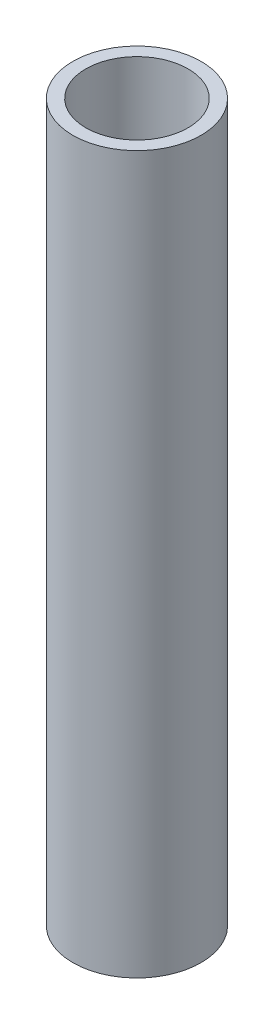
ISO-10303-21;
HEADER;
FILE_DESCRIPTION(('STEP AP214'),'2;1');
FILE_NAME('part.step','',(''),(''),'','','');
FILE_SCHEMA(('AUTOMOTIVE_DESIGN { 1 0 10303 214 1 1 1 1 }'));
ENDSEC;
DATA;
#1=APPLICATION_CONTEXT('core data for automotive mechanical design processes');
#2=APPLICATION_PROTOCOL_DEFINITION('international standard','automotive_design',2000,#1);
#3=PRODUCT_CONTEXT('',#1,'mechanical');
#4=PRODUCT('Part','Part','',(#3));
#5=PRODUCT_RELATED_PRODUCT_CATEGORY('part','',(#4));
#6=PRODUCT_DEFINITION_FORMATION('','',#4);
#7=PRODUCT_DEFINITION_CONTEXT('part definition',#1,'design');
#8=PRODUCT_DEFINITION('design','',#6,#7);
#9=PRODUCT_DEFINITION_SHAPE('','',#8);
#10=(LENGTH_UNIT() NAMED_UNIT(*) SI_UNIT(.MILLI.,.METRE.));
#11=(NAMED_UNIT(*) PLANE_ANGLE_UNIT() SI_UNIT($,.RADIAN.));
#12=(NAMED_UNIT(*) SI_UNIT($,.STERADIAN.) SOLID_ANGLE_UNIT());
#13=UNCERTAINTY_MEASURE_WITH_UNIT(LENGTH_MEASURE(1.E-05),#10,'distance_accuracy_value','');
#14=(GEOMETRIC_REPRESENTATION_CONTEXT(3) GLOBAL_UNCERTAINTY_ASSIGNED_CONTEXT((#13)) GLOBAL_UNIT_ASSIGNED_CONTEXT((#10,
#11,#12)) REPRESENTATION_CONTEXT('',''));
#15=CARTESIAN_POINT('',(0.,0.,0.));
#16=DIRECTION('',(0.,0.,1.));
#17=DIRECTION('',(1.,0.,0.));
#18=AXIS2_PLACEMENT_3D('',#15,#16,#17);
#19=CARTESIAN_POINT('',(0.,186.69,0.));
#20=DIRECTION('',(0.,1.,0.));
#21=DIRECTION('',(0.,0.,1.));
#22=AXIS2_PLACEMENT_3D('',#19,#20,#21);
#23=PLANE('',#22);
#24=CARTESIAN_POINT('',(0.,186.69,0.));
#25=DIRECTION('',(0.,1.,0.));
#26=DIRECTION('',(0.,0.,1.));
#27=AXIS2_PLACEMENT_3D('',#24,#25,#26);
#28=CIRCLE('',#27,16.7005);
#29=CARTESIAN_POINT('',(0.,186.69,16.7005));
#30=VERTEX_POINT('',#29);
#31=EDGE_CURVE('E10',#30,#30,#28,.T.);
#32=ORIENTED_EDGE('',*,*,#31,.T.);
#33=EDGE_LOOP('',(#32));
#34=FACE_BOUND('',#33,.T.);
#35=CARTESIAN_POINT('',(0.,186.69,0.));
#36=DIRECTION('',(0.,1.,0.));
#37=DIRECTION('',(0.,0.,1.));
#38=AXIS2_PLACEMENT_3D('',#35,#36,#37);
#39=CIRCLE('',#38,13.3223);
#40=CARTESIAN_POINT('',(0.,186.69,13.3223));
#41=VERTEX_POINT('',#40);
#42=EDGE_CURVE('E39',#41,#41,#39,.T.);
#43=ORIENTED_EDGE('',*,*,#42,.F.);
#44=EDGE_LOOP('',(#43));
#45=FACE_BOUND('',#44,.T.);
#46=ADVANCED_FACE('F28',(#34,#45),#23,.T.);
#47=CARTESIAN_POINT('',(0.,0.,0.));
#48=DIRECTION('',(0.,1.,0.));
#49=DIRECTION('',(0.,0.,1.));
#50=AXIS2_PLACEMENT_3D('',#47,#48,#49);
#51=PLANE('',#50);
#52=CARTESIAN_POINT('',(0.,0.,0.));
#53=DIRECTION('',(0.,1.,0.));
#54=DIRECTION('',(0.,0.,1.));
#55=AXIS2_PLACEMENT_3D('',#52,#53,#54);
#56=CIRCLE('',#55,16.7005);
#57=CARTESIAN_POINT('',(0.,0.,16.7005));
#58=VERTEX_POINT('',#57);
#59=EDGE_CURVE('E32',#58,#58,#56,.T.);
#60=ORIENTED_EDGE('',*,*,#59,.F.);
#61=EDGE_LOOP('',(#60));
#62=FACE_BOUND('',#61,.T.);
#63=CARTESIAN_POINT('',(0.,0.,0.));
#64=DIRECTION('',(0.,1.,0.));
#65=DIRECTION('',(0.,0.,1.));
#66=AXIS2_PLACEMENT_3D('',#63,#64,#65);
#67=CIRCLE('',#66,13.3223);
#68=CARTESIAN_POINT('',(0.,0.,13.3223));
#69=VERTEX_POINT('',#68);
#70=EDGE_CURVE('E41',#69,#69,#67,.T.);
#71=ORIENTED_EDGE('',*,*,#70,.T.);
#72=EDGE_LOOP('',(#71));
#73=FACE_BOUND('',#72,.T.);
#74=ADVANCED_FACE('F51',(#62,#73),#51,.F.);
#75=CARTESIAN_POINT('',(0.,186.69,0.));
#76=DIRECTION('',(0.,-1.,0.));
#77=DIRECTION('',(0.,0.,-1.));
#78=AXIS2_PLACEMENT_3D('',#75,#76,#77);
#79=CYLINDRICAL_SURFACE('',#78,16.7005);
#80=ORIENTED_EDGE('',*,*,#31,.F.);
#81=EDGE_LOOP('',(#80));
#82=FACE_BOUND('',#81,.T.);
#83=ORIENTED_EDGE('',*,*,#59,.T.);
#84=EDGE_LOOP('',(#83));
#85=FACE_BOUND('',#84,.T.);
#86=ADVANCED_FACE('F30',(#82,#85),#79,.T.);
#87=CARTESIAN_POINT('',(0.,186.69,0.));
#88=DIRECTION('',(0.,-1.,0.));
#89=DIRECTION('',(0.,0.,-1.));
#90=AXIS2_PLACEMENT_3D('',#87,#88,#89);
#91=CYLINDRICAL_SURFACE('',#90,13.3223);
#92=ORIENTED_EDGE('',*,*,#42,.T.);
#93=EDGE_LOOP('',(#92));
#94=FACE_BOUND('',#93,.T.);
#95=ORIENTED_EDGE('',*,*,#70,.F.);
#96=EDGE_LOOP('',(#95));
#97=FACE_BOUND('',#96,.T.);
#98=ADVANCED_FACE('F47',(#94,#97),#91,.F.);
#99=CLOSED_SHELL('',(#46,#74,#86,#98));
#100=MANIFOLD_SOLID_BREP('B2',#99);
#101=ADVANCED_BREP_SHAPE_REPRESENTATION('',(#18,#100),#14);
#102=SHAPE_DEFINITION_REPRESENTATION(#9,#101);
ENDSEC;
END-ISO-10303-21;
